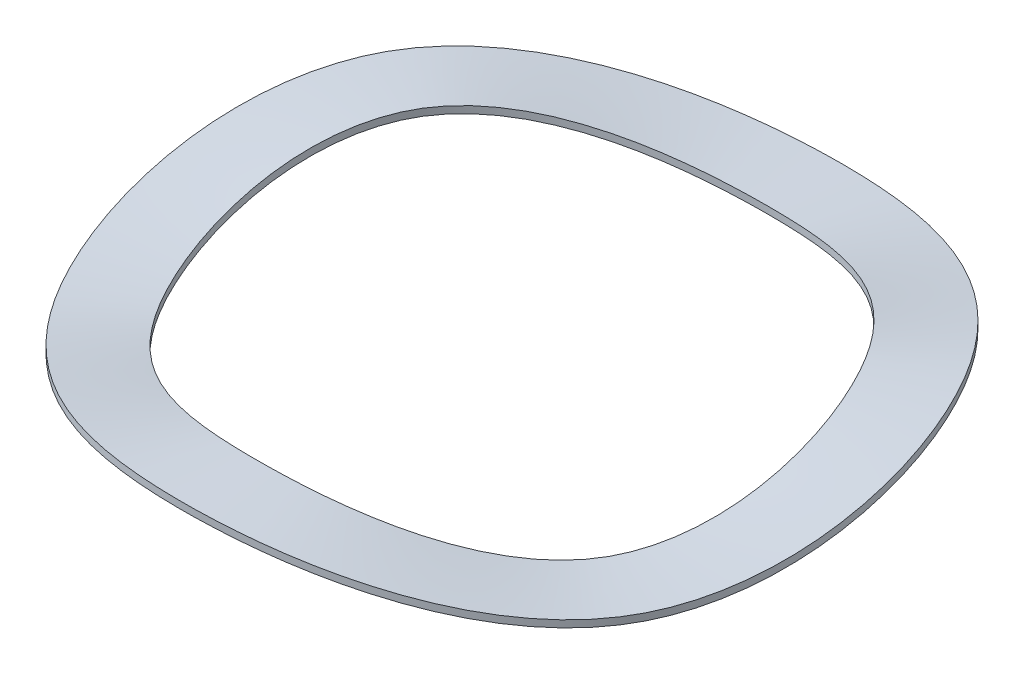
ISO-10303-21;
HEADER;
FILE_DESCRIPTION(('STEP AP214'),'2;1');
FILE_NAME('part.step','',(''),(''),'','','');
FILE_SCHEMA(('AUTOMOTIVE_DESIGN { 1 0 10303 214 1 1 1 1 }'));
ENDSEC;
DATA;
#1=APPLICATION_CONTEXT('core data for automotive mechanical design processes');
#2=APPLICATION_PROTOCOL_DEFINITION('international standard','automotive_design',2000,#1);
#3=PRODUCT_CONTEXT('',#1,'mechanical');
#4=PRODUCT('Part','Part','',(#3));
#5=PRODUCT_RELATED_PRODUCT_CATEGORY('part','',(#4));
#6=PRODUCT_DEFINITION_FORMATION('','',#4);
#7=PRODUCT_DEFINITION_CONTEXT('part definition',#1,'design');
#8=PRODUCT_DEFINITION('design','',#6,#7);
#9=PRODUCT_DEFINITION_SHAPE('','',#8);
#10=(LENGTH_UNIT() NAMED_UNIT(*) SI_UNIT(.MILLI.,.METRE.));
#11=(NAMED_UNIT(*) PLANE_ANGLE_UNIT() SI_UNIT($,.RADIAN.));
#12=(NAMED_UNIT(*) SI_UNIT($,.STERADIAN.) SOLID_ANGLE_UNIT());
#13=UNCERTAINTY_MEASURE_WITH_UNIT(LENGTH_MEASURE(1.E-05),#10,'distance_accuracy_value','');
#14=(GEOMETRIC_REPRESENTATION_CONTEXT(3) GLOBAL_UNCERTAINTY_ASSIGNED_CONTEXT((#13)) GLOBAL_UNIT_ASSIGNED_CONTEXT((#10,
#11,#12)) REPRESENTATION_CONTEXT('',''));
#15=CARTESIAN_POINT('',(0.,0.,0.));
#16=DIRECTION('',(0.,0.,1.));
#17=DIRECTION('',(1.,0.,0.));
#18=AXIS2_PLACEMENT_3D('',#15,#16,#17);
#19=CARTESIAN_POINT('',(0.,0.,-10.6553));
#20=CARTESIAN_POINT('',(3.69110419397773,0.,-10.6553));
#21=CARTESIAN_POINT('',(11.0733125819332,3.1242,-6.39318));
#22=CARTESIAN_POINT('',(11.0733125819332,-1.5621,6.39318000000003));
#23=CARTESIAN_POINT('',(0.,3.12419999999999,12.78636));
#24=CARTESIAN_POINT('',(-11.0733125819332,-1.5621,6.39317999999996));
#25=CARTESIAN_POINT('',(-11.0733125819332,1.5621,-2.13106000000005));
#26=CARTESIAN_POINT('',(-7.38220838795543,1.5621,-8.52424000000004));
#27=CARTESIAN_POINT('',(-3.69110419397772,0.,-10.6553));
#28=CARTESIAN_POINT('',(0.,0.,-10.6553));
#29=CARTESIAN_POINT('',(0.,0.,-11.6755333333333));
#30=CARTESIAN_POINT('',(4.04452338775946,0.,-11.6755333333333));
#31=CARTESIAN_POINT('',(12.1335701632784,3.1242,-7.00532));
#32=CARTESIAN_POINT('',(12.1335701632784,-1.5621,7.00532000000003));
#33=CARTESIAN_POINT('',(0.,3.1242,14.01064));
#34=CARTESIAN_POINT('',(-12.1335701632785,-1.5621,7.00531999999996));
#35=CARTESIAN_POINT('',(-12.1335701632784,1.5621,-2.33510666666672));
#36=CARTESIAN_POINT('',(-8.08904677551891,1.5621,-9.34042666666671));
#37=CARTESIAN_POINT('',(-4.04452338775946,0.,-11.6755333333333));
#38=CARTESIAN_POINT('',(0.,0.,-11.6755333333333));
#39=CARTESIAN_POINT('',(0.,0.,-12.6957666666667));
#40=CARTESIAN_POINT('',(4.3979425815412,0.,-12.6957666666667));
#41=CARTESIAN_POINT('',(13.1938277446236,3.1242,-7.61746));
#42=CARTESIAN_POINT('',(13.1938277446236,-1.5621,7.61746000000003));
#43=CARTESIAN_POINT('',(0.,3.1242,15.23492));
#44=CARTESIAN_POINT('',(-13.1938277446237,-1.5621,7.61745999999995));
#45=CARTESIAN_POINT('',(-13.1938277446236,1.5621,-2.53915333333339));
#46=CARTESIAN_POINT('',(-8.79588516308238,1.5621,-10.1566133333334));
#47=CARTESIAN_POINT('',(-4.3979425815412,0.,-12.6957666666667));
#48=CARTESIAN_POINT('',(0.,0.,-12.6957666666667));
#49=CARTESIAN_POINT('',(0.,0.,-13.716));
#50=CARTESIAN_POINT('',(4.75136177532294,0.,-13.716));
#51=CARTESIAN_POINT('',(14.2540853259689,3.1242,-8.2296));
#52=CARTESIAN_POINT('',(14.2540853259688,-1.5621,8.22960000000003));
#53=CARTESIAN_POINT('',(0.,3.1242,16.4592));
#54=CARTESIAN_POINT('',(-14.2540853259689,-1.5621,8.22959999999994));
#55=CARTESIAN_POINT('',(-14.2540853259688,1.5621,-2.74320000000006));
#56=CARTESIAN_POINT('',(-9.50272355064585,1.5621,-10.9728));
#57=CARTESIAN_POINT('',(-4.75136177532293,0.,-13.716));
#58=CARTESIAN_POINT('',(0.,0.,-13.716));
#59=B_SPLINE_SURFACE_WITH_KNOTS('',3,3,((#19,#20,#21,#22,#23,#24,#25,#26,#27,#28),(#29,#30,#31,
#32,#33,#34,#35,#36,#37,#38),(#39,#40,#41,#42,#43,#44,#45,#46,#47,#48),(#49,#50,#51,#52,#53,#54,
#55,#56,#57,#58)),.UNSPECIFIED.,.F.,.T.,.F.,(4,4),(4,1,1,1,1,2,4),(0.,1.),(0.,0.166666666666667,
0.333333333333334,0.5,0.666666666666666,0.833333333333333,1.),.UNSPECIFIED.);
#60=CARTESIAN_POINT('',(0.,0.,-10.6553));
#61=CARTESIAN_POINT('',(3.69110419397773,0.,-10.6553));
#62=CARTESIAN_POINT('',(11.0733125819332,3.1242,-6.39318));
#63=CARTESIAN_POINT('',(11.0733125819332,-1.5621,6.39318000000003));
#64=CARTESIAN_POINT('',(0.,3.12419999999999,12.78636));
#65=CARTESIAN_POINT('',(-11.0733125819332,-1.5621,6.39317999999996));
#66=CARTESIAN_POINT('',(-11.0733125819332,1.5621,-2.13106000000005));
#67=CARTESIAN_POINT('',(-7.38220838795543,1.5621,-8.52424000000004));
#68=CARTESIAN_POINT('',(-3.69110419397772,0.,-10.6553));
#69=CARTESIAN_POINT('',(0.,0.,-10.6553));
#70=B_SPLINE_CURVE_WITH_KNOTS('',3,(#60,#61,#62,#63,#64,#65,#66,#67,#68,#69),.UNSPECIFIED.,.T.,
.F.,(4,1,1,1,1,2,4),(0.,0.166666666666667,0.333333333333334,0.5,0.666666666666666,
0.833333333333333,1.),.UNSPECIFIED.);
#71=CARTESIAN_POINT('',(0.,0.,-10.6553));
#72=VERTEX_POINT('',#71);
#73=EDGE_CURVE('E31',#72,#72,#70,.T.);
#74=CARTESIAN_POINT('',(0.,0.,-13.716));
#75=CARTESIAN_POINT('',(4.75136177532294,0.,-13.716));
#76=CARTESIAN_POINT('',(14.2540853259689,3.1242,-8.2296));
#77=CARTESIAN_POINT('',(14.2540853259688,-1.5621,8.22960000000003));
#78=CARTESIAN_POINT('',(0.,3.1242,16.4592));
#79=CARTESIAN_POINT('',(-14.2540853259689,-1.5621,8.22959999999994));
#80=CARTESIAN_POINT('',(-14.2540853259688,1.5621,-2.74320000000006));
#81=CARTESIAN_POINT('',(-9.50272355064585,1.5621,-10.9728));
#82=CARTESIAN_POINT('',(-4.75136177532293,0.,-13.716));
#83=CARTESIAN_POINT('',(0.,0.,-13.716));
#84=B_SPLINE_CURVE_WITH_KNOTS('',3,(#74,#75,#76,#77,#78,#79,#80,#81,#82,#83),.UNSPECIFIED.,.T.,
.F.,(4,1,1,1,1,2,4),(0.,0.166666666666667,0.333333333333334,0.5,0.666666666666666,
0.833333333333333,1.),.UNSPECIFIED.);
#85=CARTESIAN_POINT('',(0.,0.,-13.716));
#86=VERTEX_POINT('',#85);
#87=EDGE_CURVE('E20',#86,#86,#84,.F.);
#88=ORIENTED_EDGE('',*,*,#73,.F.);
#89=EDGE_LOOP('',(#88));
#90=FACE_BOUND('',#89,.T.);
#91=ORIENTED_EDGE('',*,*,#87,.F.);
#92=EDGE_LOOP('',(#91));
#93=FACE_BOUND('',#92,.T.);
#94=ADVANCED_FACE('F14',(#90,#93),#59,.T.);
#95=CARTESIAN_POINT('',(0.,0.,-13.716));
#96=CARTESIAN_POINT('',(4.75136177532294,0.,-13.716));
#97=CARTESIAN_POINT('',(14.2540853259689,3.1242,-8.2296));
#98=CARTESIAN_POINT('',(14.2540853259688,-1.5621,8.22960000000003));
#99=CARTESIAN_POINT('',(0.,3.1242,16.4592));
#100=CARTESIAN_POINT('',(-14.2540853259689,-1.5621,8.22959999999994));
#101=CARTESIAN_POINT('',(-14.2540853259688,1.5621,-2.74320000000006));
#102=CARTESIAN_POINT('',(-9.50272355064585,1.5621,-10.9728));
#103=CARTESIAN_POINT('',(-4.75136177532293,0.,-13.716));
#104=CARTESIAN_POINT('',(0.,0.,-13.716));
#105=CARTESIAN_POINT('',(0.,0.0973666666666665,-13.716));
#106=CARTESIAN_POINT('',(4.75136177532294,0.0973666666666662,-13.716));
#107=CARTESIAN_POINT('',(14.2540853259689,3.22156666666667,-8.2296));
#108=CARTESIAN_POINT('',(14.2540853259688,-1.46473333333333,8.22960000000003));
#109=CARTESIAN_POINT('',(0.,3.22156666666666,16.4592));
#110=CARTESIAN_POINT('',(-14.2540853259689,-1.46473333333333,8.22959999999994));
#111=CARTESIAN_POINT('',(-14.2540853259688,1.65946666666666,-2.74320000000006));
#112=CARTESIAN_POINT('',(-9.50272355064585,1.65946666666667,-10.9728));
#113=CARTESIAN_POINT('',(-4.75136177532293,0.0973666666666667,-13.716));
#114=CARTESIAN_POINT('',(0.,0.0973666666666665,-13.716));
#115=CARTESIAN_POINT('',(0.,0.194733333333333,-13.716));
#116=CARTESIAN_POINT('',(4.75136177532294,0.194733333333333,-13.716));
#117=CARTESIAN_POINT('',(14.2540853259689,3.31893333333333,-8.2296));
#118=CARTESIAN_POINT('',(14.2540853259688,-1.36736666666666,8.22960000000003));
#119=CARTESIAN_POINT('',(0.,3.31893333333333,16.4592));
#120=CARTESIAN_POINT('',(-14.2540853259689,-1.36736666666667,8.22959999999994));
#121=CARTESIAN_POINT('',(-14.2540853259688,1.75683333333333,-2.74320000000006));
#122=CARTESIAN_POINT('',(-9.50272355064585,1.75683333333334,-10.9728));
#123=CARTESIAN_POINT('',(-4.75136177532293,0.194733333333333,-13.716));
#124=CARTESIAN_POINT('',(0.,0.194733333333333,-13.716));
#125=CARTESIAN_POINT('',(0.,0.292099999999999,-13.716));
#126=CARTESIAN_POINT('',(4.75136177532294,0.292099999999999,-13.716));
#127=CARTESIAN_POINT('',(14.2540853259689,3.4163,-8.2296));
#128=CARTESIAN_POINT('',(14.2540853259688,-1.27,8.22960000000003));
#129=CARTESIAN_POINT('',(0.,3.41629999999999,16.4592));
#130=CARTESIAN_POINT('',(-14.2540853259689,-1.27,8.22959999999994));
#131=CARTESIAN_POINT('',(-14.2540853259688,1.8542,-2.74320000000006));
#132=CARTESIAN_POINT('',(-9.50272355064585,1.8542,-10.9728));
#133=CARTESIAN_POINT('',(-4.75136177532293,0.2921,-13.716));
#134=CARTESIAN_POINT('',(0.,0.292099999999999,-13.716));
#135=B_SPLINE_SURFACE_WITH_KNOTS('',3,3,((#95,#96,#97,#98,#99,#100,#101,#102,#103,#104),(#105,
#106,#107,#108,#109,#110,#111,#112,#113,#114),(#115,#116,#117,#118,#119,#120,#121,#122,#123,
#124),(#125,#126,#127,#128,#129,#130,#131,#132,#133,#134)),.UNSPECIFIED.,.F.,.T.,.F.,(4,4),(4,1,
1,1,1,2,4),(0.,1.),(0.,0.166666666666667,0.333333333333334,0.5,0.666666666666666,
0.833333333333333,1.),.UNSPECIFIED.);
#136=CARTESIAN_POINT('',(0.,0.292099999999999,-13.716));
#137=CARTESIAN_POINT('',(4.75136177532294,0.292099999999999,-13.716));
#138=CARTESIAN_POINT('',(14.2540853259689,3.4163,-8.2296));
#139=CARTESIAN_POINT('',(14.2540853259688,-1.27,8.22960000000003));
#140=CARTESIAN_POINT('',(0.,3.41629999999999,16.4592));
#141=CARTESIAN_POINT('',(-14.2540853259689,-1.27,8.22959999999994));
#142=CARTESIAN_POINT('',(-14.2540853259688,1.8542,-2.74320000000006));
#143=CARTESIAN_POINT('',(-9.50272355064585,1.8542,-10.9728));
#144=CARTESIAN_POINT('',(-4.75136177532293,0.2921,-13.716));
#145=CARTESIAN_POINT('',(0.,0.292099999999999,-13.716));
#146=B_SPLINE_CURVE_WITH_KNOTS('',3,(#136,#137,#138,#139,#140,#141,#142,#143,#144,#145),
.UNSPECIFIED.,.T.,.F.,(4,1,1,1,1,2,4),(0.,0.166666666666667,0.333333333333334,0.5,
0.666666666666666,0.833333333333333,1.),.UNSPECIFIED.);
#147=CARTESIAN_POINT('',(0.,0.292099999999999,-13.716));
#148=VERTEX_POINT('',#147);
#149=EDGE_CURVE('E26',#148,#148,#146,.F.);
#150=ORIENTED_EDGE('',*,*,#87,.T.);
#151=EDGE_LOOP('',(#150));
#152=FACE_BOUND('',#151,.T.);
#153=ORIENTED_EDGE('',*,*,#149,.F.);
#154=EDGE_LOOP('',(#153));
#155=FACE_BOUND('',#154,.T.);
#156=ADVANCED_FACE('F54',(#152,#155),#135,.T.);
#157=CARTESIAN_POINT('',(0.,0.292099999999999,-10.6553));
#158=CARTESIAN_POINT('',(3.69110419397773,0.292099999999999,-10.6553));
#159=CARTESIAN_POINT('',(11.0733125819332,3.4163,-6.39318));
#160=CARTESIAN_POINT('',(11.0733125819332,-1.27,6.39318000000003));
#161=CARTESIAN_POINT('',(0.,3.4163,12.78636));
#162=CARTESIAN_POINT('',(-11.0733125819332,-1.27000000000001,6.39317999999996));
#163=CARTESIAN_POINT('',(-11.0733125819332,1.8542,-2.13106000000005));
#164=CARTESIAN_POINT('',(-7.38220838795543,1.8542,-8.52424000000004));
#165=CARTESIAN_POINT('',(-3.69110419397772,0.2921,-10.6553));
#166=CARTESIAN_POINT('',(0.,0.292099999999999,-10.6553));
#167=CARTESIAN_POINT('',(0.,0.194733333333333,-10.6553));
#168=CARTESIAN_POINT('',(3.69110419397773,0.194733333333332,-10.6553));
#169=CARTESIAN_POINT('',(11.0733125819332,3.31893333333334,-6.39318));
#170=CARTESIAN_POINT('',(11.0733125819332,-1.36736666666667,6.39318000000003));
#171=CARTESIAN_POINT('',(0.,3.31893333333333,12.78636));
#172=CARTESIAN_POINT('',(-11.0733125819332,-1.36736666666667,6.39317999999996));
#173=CARTESIAN_POINT('',(-11.0733125819332,1.75683333333333,-2.13106000000005));
#174=CARTESIAN_POINT('',(-7.38220838795543,1.75683333333334,-8.52424000000004));
#175=CARTESIAN_POINT('',(-3.69110419397772,0.194733333333333,-10.6553));
#176=CARTESIAN_POINT('',(0.,0.194733333333333,-10.6553));
#177=CARTESIAN_POINT('',(0.,0.0973666666666658,-10.6553));
#178=CARTESIAN_POINT('',(3.69110419397773,0.0973666666666655,-10.6553));
#179=CARTESIAN_POINT('',(11.0733125819332,3.22156666666667,-6.39318));
#180=CARTESIAN_POINT('',(11.0733125819332,-1.46473333333333,6.39318000000003));
#181=CARTESIAN_POINT('',(0.,3.22156666666666,12.78636));
#182=CARTESIAN_POINT('',(-11.0733125819332,-1.46473333333333,6.39317999999996));
#183=CARTESIAN_POINT('',(-11.0733125819332,1.65946666666666,-2.13106000000005));
#184=CARTESIAN_POINT('',(-7.38220838795543,1.65946666666667,-8.52424000000004));
#185=CARTESIAN_POINT('',(-3.69110419397772,0.0973666666666661,-10.6553));
#186=CARTESIAN_POINT('',(0.,0.0973666666666658,-10.6553));
#187=CARTESIAN_POINT('',(0.,0.,-10.6553));
#188=CARTESIAN_POINT('',(3.69110419397773,0.,-10.6553));
#189=CARTESIAN_POINT('',(11.0733125819332,3.1242,-6.39318));
#190=CARTESIAN_POINT('',(11.0733125819332,-1.5621,6.39318000000003));
#191=CARTESIAN_POINT('',(0.,3.12419999999999,12.78636));
#192=CARTESIAN_POINT('',(-11.0733125819332,-1.5621,6.39317999999996));
#193=CARTESIAN_POINT('',(-11.0733125819332,1.5621,-2.13106000000005));
#194=CARTESIAN_POINT('',(-7.38220838795543,1.5621,-8.52424000000004));
#195=CARTESIAN_POINT('',(-3.69110419397772,0.,-10.6553));
#196=CARTESIAN_POINT('',(0.,0.,-10.6553));
#197=B_SPLINE_SURFACE_WITH_KNOTS('',3,3,((#157,#158,#159,#160,#161,#162,#163,#164,#165,#166),
(#167,#168,#169,#170,#171,#172,#173,#174,#175,#176),(#177,#178,#179,#180,#181,#182,#183,#184,
#185,#186),(#187,#188,#189,#190,#191,#192,#193,#194,#195,#196)),.UNSPECIFIED.,.F.,.T.,.F.,(4,4),
(4,1,1,1,1,2,4),(0.,1.),(0.,0.166666666666667,0.333333333333334,0.5,0.666666666666666,
0.833333333333333,1.),.UNSPECIFIED.);
#198=CARTESIAN_POINT('',(0.,0.292099999999999,-10.6553));
#199=CARTESIAN_POINT('',(3.69110419397773,0.292099999999999,-10.6553));
#200=CARTESIAN_POINT('',(11.0733125819332,3.4163,-6.39318));
#201=CARTESIAN_POINT('',(11.0733125819332,-1.27,6.39318000000003));
#202=CARTESIAN_POINT('',(0.,3.4163,12.78636));
#203=CARTESIAN_POINT('',(-11.0733125819332,-1.27000000000001,6.39317999999997));
#204=CARTESIAN_POINT('',(-11.0733125819332,1.8542,-2.13106000000005));
#205=CARTESIAN_POINT('',(-7.38220838795543,1.8542,-8.52424000000004));
#206=CARTESIAN_POINT('',(-3.69110419397772,0.2921,-10.6553));
#207=CARTESIAN_POINT('',(0.,0.292099999999999,-10.6553));
#208=B_SPLINE_CURVE_WITH_KNOTS('',3,(#198,#199,#200,#201,#202,#203,#204,#205,#206,#207),
.UNSPECIFIED.,.T.,.F.,(4,1,1,1,1,2,4),(0.,0.166666666666667,0.333333333333334,0.5,
0.666666666666666,0.833333333333333,1.),.UNSPECIFIED.);
#209=CARTESIAN_POINT('',(0.,0.292099999999999,-10.6553));
#210=VERTEX_POINT('',#209);
#211=EDGE_CURVE('E10',#210,#210,#208,.T.);
#212=ORIENTED_EDGE('',*,*,#73,.T.);
#213=EDGE_LOOP('',(#212));
#214=FACE_BOUND('',#213,.T.);
#215=ORIENTED_EDGE('',*,*,#211,.F.);
#216=EDGE_LOOP('',(#215));
#217=FACE_BOUND('',#216,.T.);
#218=ADVANCED_FACE('F64',(#214,#217),#197,.T.);
#219=CARTESIAN_POINT('',(0.,0.292099999999999,-13.716));
#220=CARTESIAN_POINT('',(4.75136177532294,0.292099999999999,-13.716));
#221=CARTESIAN_POINT('',(14.2540853259689,3.4163,-8.2296));
#222=CARTESIAN_POINT('',(14.2540853259688,-1.27,8.22960000000003));
#223=CARTESIAN_POINT('',(0.,3.41629999999999,16.4592));
#224=CARTESIAN_POINT('',(-14.2540853259689,-1.27,8.22959999999994));
#225=CARTESIAN_POINT('',(-14.2540853259688,1.8542,-2.74320000000006));
#226=CARTESIAN_POINT('',(-9.50272355064585,1.8542,-10.9728));
#227=CARTESIAN_POINT('',(-4.75136177532293,0.2921,-13.716));
#228=CARTESIAN_POINT('',(0.,0.292099999999999,-13.716));
#229=CARTESIAN_POINT('',(0.,0.292099999999999,-12.6957666666667));
#230=CARTESIAN_POINT('',(4.3979425815412,0.292099999999999,-12.6957666666667));
#231=CARTESIAN_POINT('',(13.1938277446236,3.4163,-7.61746));
#232=CARTESIAN_POINT('',(13.1938277446236,-1.27,7.61746000000003));
#233=CARTESIAN_POINT('',(0.,3.4163,15.23492));
#234=CARTESIAN_POINT('',(-13.1938277446237,-1.27,7.61745999999995));
#235=CARTESIAN_POINT('',(-13.1938277446236,1.8542,-2.53915333333339));
#236=CARTESIAN_POINT('',(-8.79588516308238,1.8542,-10.1566133333334));
#237=CARTESIAN_POINT('',(-4.3979425815412,0.2921,-12.6957666666667));
#238=CARTESIAN_POINT('',(0.,0.292099999999999,-12.6957666666667));
#239=CARTESIAN_POINT('',(0.,0.292099999999999,-11.6755333333333));
#240=CARTESIAN_POINT('',(4.04452338775947,0.292099999999998,-11.6755333333333));
#241=CARTESIAN_POINT('',(12.1335701632784,3.4163,-7.00532));
#242=CARTESIAN_POINT('',(12.1335701632784,-1.27,7.00532000000003));
#243=CARTESIAN_POINT('',(0.,3.4163,14.01064));
#244=CARTESIAN_POINT('',(-12.1335701632785,-1.27000000000001,7.00531999999996));
#245=CARTESIAN_POINT('',(-12.1335701632784,1.8542,-2.33510666666672));
#246=CARTESIAN_POINT('',(-8.08904677551891,1.8542,-9.34042666666671));
#247=CARTESIAN_POINT('',(-4.04452338775946,0.2921,-11.6755333333333));
#248=CARTESIAN_POINT('',(0.,0.292099999999999,-11.6755333333333));
#249=CARTESIAN_POINT('',(0.,0.292099999999999,-10.6553));
#250=CARTESIAN_POINT('',(3.69110419397773,0.292099999999999,-10.6553));
#251=CARTESIAN_POINT('',(11.0733125819332,3.4163,-6.39318));
#252=CARTESIAN_POINT('',(11.0733125819332,-1.27,6.39318000000003));
#253=CARTESIAN_POINT('',(0.,3.4163,12.78636));
#254=CARTESIAN_POINT('',(-11.0733125819332,-1.27000000000001,6.39317999999997));
#255=CARTESIAN_POINT('',(-11.0733125819332,1.8542,-2.13106000000005));
#256=CARTESIAN_POINT('',(-7.38220838795543,1.8542,-8.52424000000004));
#257=CARTESIAN_POINT('',(-3.69110419397772,0.2921,-10.6553));
#258=CARTESIAN_POINT('',(0.,0.292099999999999,-10.6553));
#259=B_SPLINE_SURFACE_WITH_KNOTS('',3,3,((#219,#220,#221,#222,#223,#224,#225,#226,#227,#228),
(#229,#230,#231,#232,#233,#234,#235,#236,#237,#238),(#239,#240,#241,#242,#243,#244,#245,#246,
#247,#248),(#249,#250,#251,#252,#253,#254,#255,#256,#257,#258)),.UNSPECIFIED.,.F.,.T.,.F.,(4,4),
(4,1,1,1,1,2,4),(0.,1.),(0.,0.166666666666667,0.333333333333334,0.5,0.666666666666666,
0.833333333333333,1.),.UNSPECIFIED.);
#260=ORIENTED_EDGE('',*,*,#149,.T.);
#261=EDGE_LOOP('',(#260));
#262=FACE_BOUND('',#261,.T.);
#263=ORIENTED_EDGE('',*,*,#211,.T.);
#264=EDGE_LOOP('',(#263));
#265=FACE_BOUND('',#264,.T.);
#266=ADVANCED_FACE('F16',(#262,#265),#259,.T.);
#267=CLOSED_SHELL('',(#94,#156,#218,#266));
#268=MANIFOLD_SOLID_BREP('B1',#267);
#269=ADVANCED_BREP_SHAPE_REPRESENTATION('',(#18,#268),#14);
#270=SHAPE_DEFINITION_REPRESENTATION(#9,#269);
ENDSEC;
END-ISO-10303-21;
